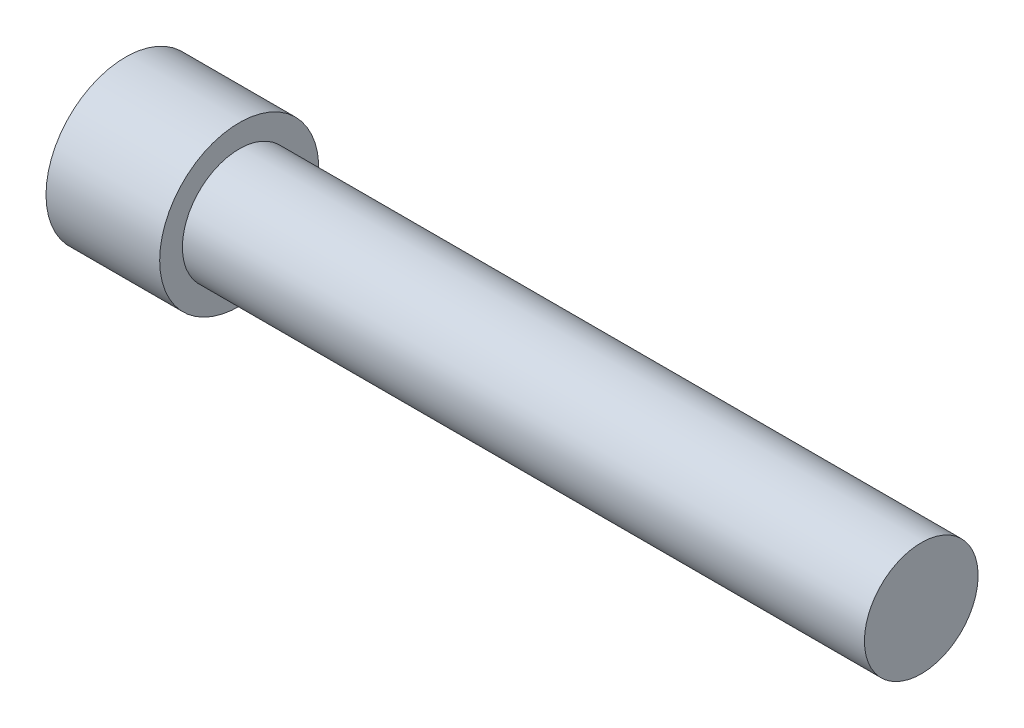
ISO-10303-21;
HEADER;
FILE_DESCRIPTION(('STEP AP214'),'2;1');
FILE_NAME('part.step','',(''),(''),'','','');
FILE_SCHEMA(('AUTOMOTIVE_DESIGN { 1 0 10303 214 1 1 1 1 }'));
ENDSEC;
DATA;
#1=APPLICATION_CONTEXT('core data for automotive mechanical design processes');
#2=APPLICATION_PROTOCOL_DEFINITION('international standard','automotive_design',2000,#1);
#3=PRODUCT_CONTEXT('',#1,'mechanical');
#4=PRODUCT('Part','Part','',(#3));
#5=PRODUCT_RELATED_PRODUCT_CATEGORY('part','',(#4));
#6=PRODUCT_DEFINITION_FORMATION('','',#4);
#7=PRODUCT_DEFINITION_CONTEXT('part definition',#1,'design');
#8=PRODUCT_DEFINITION('design','',#6,#7);
#9=PRODUCT_DEFINITION_SHAPE('','',#8);
#10=(LENGTH_UNIT() NAMED_UNIT(*) SI_UNIT(.MILLI.,.METRE.));
#11=(NAMED_UNIT(*) PLANE_ANGLE_UNIT() SI_UNIT($,.RADIAN.));
#12=(NAMED_UNIT(*) SI_UNIT($,.STERADIAN.) SOLID_ANGLE_UNIT());
#13=UNCERTAINTY_MEASURE_WITH_UNIT(LENGTH_MEASURE(1.E-05),#10,'distance_accuracy_value','');
#14=(GEOMETRIC_REPRESENTATION_CONTEXT(3) GLOBAL_UNCERTAINTY_ASSIGNED_CONTEXT((#13)) GLOBAL_UNIT_ASSIGNED_CONTEXT((#10,
#11,#12)) REPRESENTATION_CONTEXT('',''));
#15=CARTESIAN_POINT('',(0.,0.,0.));
#16=DIRECTION('',(0.,0.,1.));
#17=DIRECTION('',(1.,0.,0.));
#18=AXIS2_PLACEMENT_3D('',#15,#16,#17);
#19=CARTESIAN_POINT('',(0.,0.,0.));
#20=DIRECTION('',(1.,0.,0.));
#21=DIRECTION('',(0.,0.,-1.));
#22=AXIS2_PLACEMENT_3D('',#19,#20,#21);
#23=PLANE('',#22);
#24=CARTESIAN_POINT('',(0.,0.,0.));
#25=DIRECTION('',(-1.,0.,0.));
#26=DIRECTION('',(0.,0.,1.));
#27=AXIS2_PLACEMENT_3D('',#24,#25,#26);
#28=CIRCLE('',#27,3.5);
#29=CARTESIAN_POINT('',(0.,0.,3.5));
#30=VERTEX_POINT('',#29);
#31=EDGE_CURVE('E10',#30,#30,#28,.T.);
#32=ORIENTED_EDGE('',*,*,#31,.T.);
#33=EDGE_LOOP('',(#32));
#34=FACE_BOUND('',#33,.T.);
#35=ADVANCED_FACE('F37',(#34),#23,.F.);
#36=CARTESIAN_POINT('',(0.,0.,0.));
#37=DIRECTION('',(-1.,0.,0.));
#38=DIRECTION('',(0.,0.,1.));
#39=AXIS2_PLACEMENT_3D('',#36,#37,#38);
#40=CYLINDRICAL_SURFACE('',#39,3.5);
#41=ORIENTED_EDGE('',*,*,#31,.F.);
#42=EDGE_LOOP('',(#41));
#43=FACE_BOUND('',#42,.T.);
#44=CARTESIAN_POINT('',(5.,0.,0.));
#45=DIRECTION('',(-1.,0.,0.));
#46=DIRECTION('',(0.,0.,1.));
#47=AXIS2_PLACEMENT_3D('',#44,#45,#46);
#48=CIRCLE('',#47,3.5);
#49=CARTESIAN_POINT('',(5.,0.,3.5));
#50=VERTEX_POINT('',#49);
#51=EDGE_CURVE('E44',#50,#50,#48,.T.);
#52=ORIENTED_EDGE('',*,*,#51,.T.);
#53=EDGE_LOOP('',(#52));
#54=FACE_BOUND('',#53,.T.);
#55=ADVANCED_FACE('F73',(#43,#54),#40,.T.);
#56=CARTESIAN_POINT('',(5.,3.5,0.));
#57=DIRECTION('',(-1.,0.,0.));
#58=DIRECTION('',(0.,0.,1.));
#59=AXIS2_PLACEMENT_3D('',#56,#57,#58);
#60=PLANE('',#59);
#61=ORIENTED_EDGE('',*,*,#51,.F.);
#62=EDGE_LOOP('',(#61));
#63=FACE_BOUND('',#62,.T.);
#64=CARTESIAN_POINT('',(5.,0.,0.));
#65=DIRECTION('',(-1.,0.,0.));
#66=DIRECTION('',(0.,0.,1.));
#67=AXIS2_PLACEMENT_3D('',#64,#65,#66);
#68=CIRCLE('',#67,2.5);
#69=CARTESIAN_POINT('',(5.,0.,2.5));
#70=VERTEX_POINT('',#69);
#71=EDGE_CURVE('E49',#70,#70,#68,.T.);
#72=ORIENTED_EDGE('',*,*,#71,.T.);
#73=EDGE_LOOP('',(#72));
#74=FACE_BOUND('',#73,.T.);
#75=ADVANCED_FACE('F69',(#63,#74),#60,.F.);
#76=CARTESIAN_POINT('',(0.,0.,0.));
#77=DIRECTION('',(-1.,0.,0.));
#78=DIRECTION('',(0.,0.,1.));
#79=AXIS2_PLACEMENT_3D('',#76,#77,#78);
#80=CYLINDRICAL_SURFACE('',#79,2.5);
#81=ORIENTED_EDGE('',*,*,#71,.F.);
#82=EDGE_LOOP('',(#81));
#83=FACE_BOUND('',#82,.T.);
#84=CARTESIAN_POINT('',(35.,0.,0.));
#85=DIRECTION('',(-1.,0.,0.));
#86=DIRECTION('',(0.,0.,1.));
#87=AXIS2_PLACEMENT_3D('',#84,#85,#86);
#88=CIRCLE('',#87,2.5);
#89=CARTESIAN_POINT('',(35.,0.,2.5));
#90=VERTEX_POINT('',#89);
#91=EDGE_CURVE('E54',#90,#90,#88,.T.);
#92=ORIENTED_EDGE('',*,*,#91,.T.);
#93=EDGE_LOOP('',(#92));
#94=FACE_BOUND('',#93,.T.);
#95=ADVANCED_FACE('F61',(#83,#94),#80,.T.);
#96=CARTESIAN_POINT('',(35.,2.5,0.));
#97=DIRECTION('',(-1.,0.,0.));
#98=DIRECTION('',(0.,0.,1.));
#99=AXIS2_PLACEMENT_3D('',#96,#97,#98);
#100=PLANE('',#99);
#101=ORIENTED_EDGE('',*,*,#91,.F.);
#102=EDGE_LOOP('',(#101));
#103=FACE_BOUND('',#102,.T.);
#104=ADVANCED_FACE('F63',(#103),#100,.F.);
#105=CLOSED_SHELL('',(#35,#55,#75,#95,#104));
#106=MANIFOLD_SOLID_BREP('B2',#105);
#107=ADVANCED_BREP_SHAPE_REPRESENTATION('',(#18,#106),#14);
#108=SHAPE_DEFINITION_REPRESENTATION(#9,#107);
ENDSEC;
END-ISO-10303-21;
